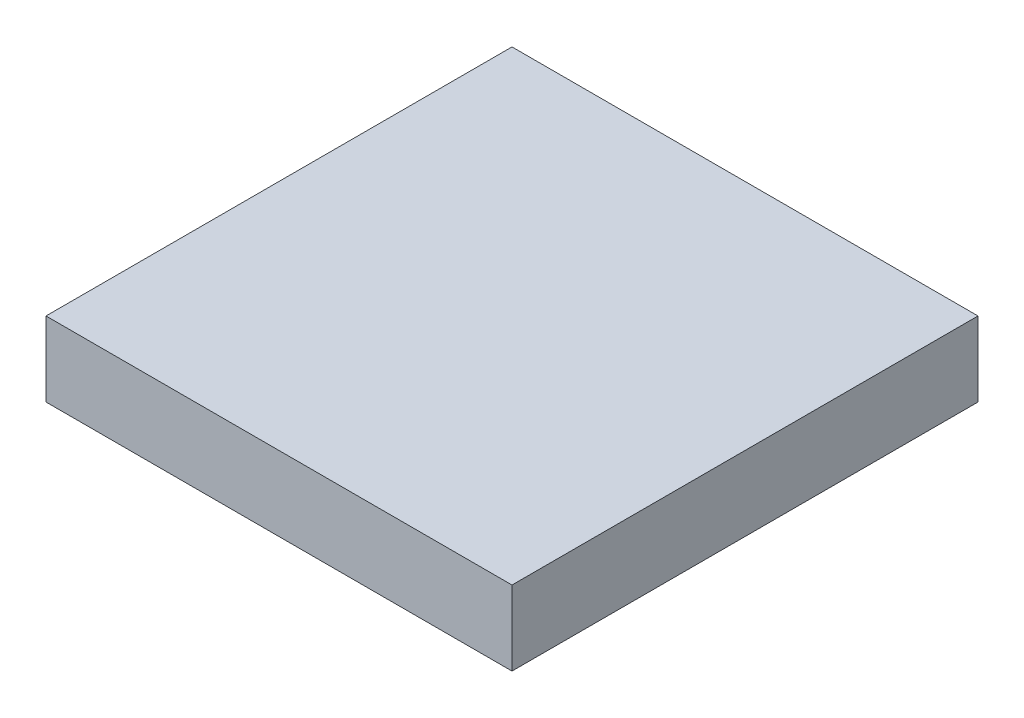
ISO-10303-21;
HEADER;
FILE_DESCRIPTION(('STEP AP214'),'2;1');
FILE_NAME('part.step','',(''),(''),'','','');
FILE_SCHEMA(('AUTOMOTIVE_DESIGN { 1 0 10303 214 1 1 1 1 }'));
ENDSEC;
DATA;
#1=APPLICATION_CONTEXT('core data for automotive mechanical design processes');
#2=APPLICATION_PROTOCOL_DEFINITION('international standard','automotive_design',2000,#1);
#3=PRODUCT_CONTEXT('',#1,'mechanical');
#4=PRODUCT('Part','Part','',(#3));
#5=PRODUCT_RELATED_PRODUCT_CATEGORY('part','',(#4));
#6=PRODUCT_DEFINITION_FORMATION('','',#4);
#7=PRODUCT_DEFINITION_CONTEXT('part definition',#1,'design');
#8=PRODUCT_DEFINITION('design','',#6,#7);
#9=PRODUCT_DEFINITION_SHAPE('','',#8);
#10=(LENGTH_UNIT() NAMED_UNIT(*) SI_UNIT(.MILLI.,.METRE.));
#11=(NAMED_UNIT(*) PLANE_ANGLE_UNIT() SI_UNIT($,.RADIAN.));
#12=(NAMED_UNIT(*) SI_UNIT($,.STERADIAN.) SOLID_ANGLE_UNIT());
#13=UNCERTAINTY_MEASURE_WITH_UNIT(LENGTH_MEASURE(1.E-05),#10,'distance_accuracy_value','');
#14=(GEOMETRIC_REPRESENTATION_CONTEXT(3) GLOBAL_UNCERTAINTY_ASSIGNED_CONTEXT((#13)) GLOBAL_UNIT_ASSIGNED_CONTEXT((#10,
#11,#12)) REPRESENTATION_CONTEXT('',''));
#15=CARTESIAN_POINT('',(0.,0.,0.));
#16=DIRECTION('',(0.,0.,1.));
#17=DIRECTION('',(1.,0.,0.));
#18=AXIS2_PLACEMENT_3D('',#15,#16,#17);
#19=CARTESIAN_POINT('',(9.525,3.048,9.525));
#20=DIRECTION('',(-1.,0.,0.));
#21=DIRECTION('',(0.,0.,1.));
#22=AXIS2_PLACEMENT_3D('',#19,#20,#21);
#23=PLANE('',#22);
#24=DIRECTION('',(0.,0.,-1.));
#25=VECTOR('',#24,1.);
#26=CARTESIAN_POINT('',(9.525,0.,9.525));
#27=LINE('',#26,#25);
#28=CARTESIAN_POINT('',(9.525,0.,9.525));
#29=VERTEX_POINT('',#28);
#30=CARTESIAN_POINT('',(9.525,0.,-9.525));
#31=VERTEX_POINT('',#30);
#32=EDGE_CURVE('E96',#29,#31,#27,.T.);
#33=ORIENTED_EDGE('',*,*,#32,.T.);
#34=DIRECTION('',(0.,-1.,0.));
#35=VECTOR('',#34,1.);
#36=CARTESIAN_POINT('',(9.525,3.048,-9.525));
#37=LINE('',#36,#35);
#38=CARTESIAN_POINT('',(9.525,3.048,-9.525));
#39=VERTEX_POINT('',#38);
#40=EDGE_CURVE('E11',#39,#31,#37,.T.);
#41=ORIENTED_EDGE('',*,*,#40,.F.);
#42=DIRECTION('',(0.,0.,-1.));
#43=VECTOR('',#42,1.);
#44=CARTESIAN_POINT('',(9.525,3.048,9.525));
#45=LINE('',#44,#43);
#46=CARTESIAN_POINT('',(9.525,3.048,9.525));
#47=VERTEX_POINT('',#46);
#48=EDGE_CURVE('E84',#47,#39,#45,.T.);
#49=ORIENTED_EDGE('',*,*,#48,.F.);
#50=DIRECTION('',(0.,-1.,0.));
#51=VECTOR('',#50,1.);
#52=CARTESIAN_POINT('',(9.525,3.048,9.525));
#53=LINE('',#52,#51);
#54=EDGE_CURVE('E92',#47,#29,#53,.T.);
#55=ORIENTED_EDGE('',*,*,#54,.T.);
#56=EDGE_LOOP('',(#33,#41,#49,#55));
#57=FACE_BOUND('',#56,.T.);
#58=ADVANCED_FACE('F33',(#57),#23,.F.);
#59=CARTESIAN_POINT('',(-9.525,3.048,-9.525));
#60=DIRECTION('',(0.,0.,1.));
#61=DIRECTION('',(1.,0.,0.));
#62=AXIS2_PLACEMENT_3D('',#59,#60,#61);
#63=PLANE('',#62);
#64=DIRECTION('',(-1.,0.,0.));
#65=VECTOR('',#64,1.);
#66=CARTESIAN_POINT('',(-9.525,0.,-9.525));
#67=LINE('',#66,#65);
#68=CARTESIAN_POINT('',(-9.525,0.,-9.525));
#69=VERTEX_POINT('',#68);
#70=EDGE_CURVE('E88',#31,#69,#67,.T.);
#71=ORIENTED_EDGE('',*,*,#70,.T.);
#72=DIRECTION('',(0.,-1.,0.));
#73=VECTOR('',#72,1.);
#74=CARTESIAN_POINT('',(-9.525,3.048,-9.525));
#75=LINE('',#74,#73);
#76=CARTESIAN_POINT('',(-9.525,3.048,-9.525));
#77=VERTEX_POINT('',#76);
#78=EDGE_CURVE('E41',#77,#69,#75,.T.);
#79=ORIENTED_EDGE('',*,*,#78,.F.);
#80=DIRECTION('',(-1.,0.,0.));
#81=VECTOR('',#80,1.);
#82=CARTESIAN_POINT('',(-9.525,3.048,-9.525));
#83=LINE('',#82,#81);
#84=EDGE_CURVE('E79',#39,#77,#83,.T.);
#85=ORIENTED_EDGE('',*,*,#84,.F.);
#86=ORIENTED_EDGE('',*,*,#40,.T.);
#87=EDGE_LOOP('',(#71,#79,#85,#86));
#88=FACE_BOUND('',#87,.T.);
#89=ADVANCED_FACE('F87',(#88),#63,.F.);
#90=CARTESIAN_POINT('',(-9.525,3.048,9.525));
#91=DIRECTION('',(1.,0.,0.));
#92=DIRECTION('',(0.,0.,-1.));
#93=AXIS2_PLACEMENT_3D('',#90,#91,#92);
#94=PLANE('',#93);
#95=DIRECTION('',(0.,0.,1.));
#96=VECTOR('',#95,1.);
#97=CARTESIAN_POINT('',(-9.525,0.,9.525));
#98=LINE('',#97,#96);
#99=CARTESIAN_POINT('',(-9.525,0.,9.525));
#100=VERTEX_POINT('',#99);
#101=EDGE_CURVE('E66',#69,#100,#98,.T.);
#102=ORIENTED_EDGE('',*,*,#101,.T.);
#103=DIRECTION('',(0.,-1.,0.));
#104=VECTOR('',#103,1.);
#105=CARTESIAN_POINT('',(-9.525,3.048,9.525));
#106=LINE('',#105,#104);
#107=CARTESIAN_POINT('',(-9.525,3.048,9.525));
#108=VERTEX_POINT('',#107);
#109=EDGE_CURVE('E89',#108,#100,#106,.T.);
#110=ORIENTED_EDGE('',*,*,#109,.F.);
#111=DIRECTION('',(0.,0.,1.));
#112=VECTOR('',#111,1.);
#113=CARTESIAN_POINT('',(-9.525,3.048,9.525));
#114=LINE('',#113,#112);
#115=EDGE_CURVE('E82',#77,#108,#114,.T.);
#116=ORIENTED_EDGE('',*,*,#115,.F.);
#117=ORIENTED_EDGE('',*,*,#78,.T.);
#118=EDGE_LOOP('',(#102,#110,#116,#117));
#119=FACE_BOUND('',#118,.T.);
#120=ADVANCED_FACE('F90',(#119),#94,.F.);
#121=CARTESIAN_POINT('',(-9.525,3.048,9.525));
#122=DIRECTION('',(0.,0.,-1.));
#123=DIRECTION('',(-1.,0.,0.));
#124=AXIS2_PLACEMENT_3D('',#121,#122,#123);
#125=PLANE('',#124);
#126=DIRECTION('',(1.,0.,0.));
#127=VECTOR('',#126,1.);
#128=CARTESIAN_POINT('',(-9.525,0.,9.525));
#129=LINE('',#128,#127);
#130=EDGE_CURVE('E72',#100,#29,#129,.T.);
#131=ORIENTED_EDGE('',*,*,#130,.T.);
#132=ORIENTED_EDGE('',*,*,#54,.F.);
#133=DIRECTION('',(1.,0.,0.));
#134=VECTOR('',#133,1.);
#135=CARTESIAN_POINT('',(-9.525,3.048,9.525));
#136=LINE('',#135,#134);
#137=EDGE_CURVE('E49',#108,#47,#136,.T.);
#138=ORIENTED_EDGE('',*,*,#137,.F.);
#139=ORIENTED_EDGE('',*,*,#109,.T.);
#140=EDGE_LOOP('',(#131,#132,#138,#139));
#141=FACE_BOUND('',#140,.T.);
#142=ADVANCED_FACE('F103',(#141),#125,.F.);
#143=CARTESIAN_POINT('',(0.,3.048,0.));
#144=DIRECTION('',(0.,-1.,0.));
#145=DIRECTION('',(0.,0.,-1.));
#146=AXIS2_PLACEMENT_3D('',#143,#144,#145);
#147=PLANE('',#146);
#148=ORIENTED_EDGE('',*,*,#48,.T.);
#149=ORIENTED_EDGE('',*,*,#84,.T.);
#150=ORIENTED_EDGE('',*,*,#115,.T.);
#151=ORIENTED_EDGE('',*,*,#137,.T.);
#152=EDGE_LOOP('',(#148,#149,#150,#151));
#153=FACE_BOUND('',#152,.T.);
#154=ADVANCED_FACE('F80',(#153),#147,.F.);
#155=CARTESIAN_POINT('',(0.,0.,0.));
#156=DIRECTION('',(0.,-1.,0.));
#157=DIRECTION('',(0.,0.,-1.));
#158=AXIS2_PLACEMENT_3D('',#155,#156,#157);
#159=PLANE('',#158);
#160=ORIENTED_EDGE('',*,*,#32,.F.);
#161=ORIENTED_EDGE('',*,*,#130,.F.);
#162=ORIENTED_EDGE('',*,*,#101,.F.);
#163=ORIENTED_EDGE('',*,*,#70,.F.);
#164=EDGE_LOOP('',(#160,#161,#162,#163));
#165=FACE_BOUND('',#164,.T.);
#166=ADVANCED_FACE('F106',(#165),#159,.T.);
#167=CLOSED_SHELL('',(#58,#89,#120,#142,#154,#166));
#168=MANIFOLD_SOLID_BREP('B2',#167);
#169=ADVANCED_BREP_SHAPE_REPRESENTATION('',(#18,#168),#14);
#170=SHAPE_DEFINITION_REPRESENTATION(#9,#169);
ENDSEC;
END-ISO-10303-21;
